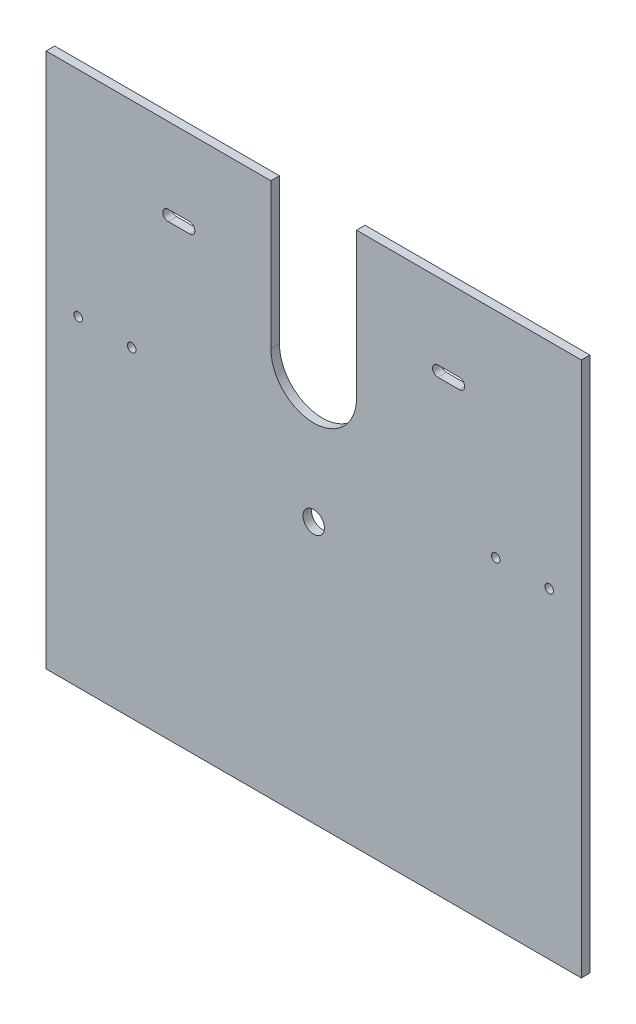
ISO-10303-21;
HEADER;
FILE_DESCRIPTION(('STEP AP214'),'2;1');
FILE_NAME('part.step','',(''),(''),'','','');
FILE_SCHEMA(('AUTOMOTIVE_DESIGN { 1 0 10303 214 1 1 1 1 }'));
ENDSEC;
DATA;
#1=APPLICATION_CONTEXT('core data for automotive mechanical design processes');
#2=APPLICATION_PROTOCOL_DEFINITION('international standard','automotive_design',2000,#1);
#3=PRODUCT_CONTEXT('',#1,'mechanical');
#4=PRODUCT('Part','Part','',(#3));
#5=PRODUCT_RELATED_PRODUCT_CATEGORY('part','',(#4));
#6=PRODUCT_DEFINITION_FORMATION('','',#4);
#7=PRODUCT_DEFINITION_CONTEXT('part definition',#1,'design');
#8=PRODUCT_DEFINITION('design','',#6,#7);
#9=PRODUCT_DEFINITION_SHAPE('','',#8);
#10=(LENGTH_UNIT() NAMED_UNIT(*) SI_UNIT(.MILLI.,.METRE.));
#11=(NAMED_UNIT(*) PLANE_ANGLE_UNIT() SI_UNIT($,.RADIAN.));
#12=(NAMED_UNIT(*) SI_UNIT($,.STERADIAN.) SOLID_ANGLE_UNIT());
#13=UNCERTAINTY_MEASURE_WITH_UNIT(LENGTH_MEASURE(1.E-05),#10,'distance_accuracy_value','');
#14=(GEOMETRIC_REPRESENTATION_CONTEXT(3) GLOBAL_UNCERTAINTY_ASSIGNED_CONTEXT((#13)) GLOBAL_UNIT_ASSIGNED_CONTEXT((#10,
#11,#12)) REPRESENTATION_CONTEXT('',''));
#15=CARTESIAN_POINT('',(0.,0.,0.));
#16=DIRECTION('',(0.,0.,1.));
#17=DIRECTION('',(1.,0.,0.));
#18=AXIS2_PLACEMENT_3D('',#15,#16,#17);
#19=CARTESIAN_POINT('',(125.,100.,4.));
#20=DIRECTION('',(0.,-1.,0.));
#21=DIRECTION('',(1.,0.,0.));
#22=AXIS2_PLACEMENT_3D('',#19,#20,#21);
#23=PLANE('',#22);
#24=DIRECTION('',(-1.,0.,0.));
#25=VECTOR('',#24,1.);
#26=CARTESIAN_POINT('',(125.,100.,4.));
#27=LINE('',#26,#25);
#28=CARTESIAN_POINT('',(-20.,100.,4.));
#29=VERTEX_POINT('',#28);
#30=CARTESIAN_POINT('',(-125.,100.,4.));
#31=VERTEX_POINT('',#30);
#32=EDGE_CURVE('E301',#29,#31,#27,.T.);
#33=ORIENTED_EDGE('',*,*,#32,.F.);
#34=DIRECTION('',(0.,0.,1.));
#35=VECTOR('',#34,1.);
#36=CARTESIAN_POINT('',(-20.,100.,0.));
#37=LINE('',#36,#35);
#38=CARTESIAN_POINT('',(-20.,100.,0.));
#39=VERTEX_POINT('',#38);
#40=EDGE_CURVE('E209',#39,#29,#37,.T.);
#41=ORIENTED_EDGE('',*,*,#40,.F.);
#42=DIRECTION('',(-1.,0.,0.));
#43=VECTOR('',#42,1.);
#44=CARTESIAN_POINT('',(125.,100.,0.));
#45=LINE('',#44,#43);
#46=CARTESIAN_POINT('',(-125.,100.,0.));
#47=VERTEX_POINT('',#46);
#48=EDGE_CURVE('E306',#39,#47,#45,.T.);
#49=ORIENTED_EDGE('',*,*,#48,.T.);
#50=DIRECTION('',(0.,0.,-1.));
#51=VECTOR('',#50,1.);
#52=CARTESIAN_POINT('',(-125.,100.,4.));
#53=LINE('',#52,#51);
#54=EDGE_CURVE('E47',#31,#47,#53,.T.);
#55=ORIENTED_EDGE('',*,*,#54,.F.);
#56=EDGE_LOOP('',(#33,#41,#49,#55));
#57=FACE_BOUND('',#56,.T.);
#58=ADVANCED_FACE('F39',(#57),#23,.F.);
#59=CARTESIAN_POINT('',(-125.,-100.,4.));
#60=DIRECTION('',(1.,0.,0.));
#61=DIRECTION('',(0.,0.,-1.));
#62=AXIS2_PLACEMENT_3D('',#59,#60,#61);
#63=PLANE('',#62);
#64=DIRECTION('',(0.,-1.,0.));
#65=VECTOR('',#64,1.);
#66=CARTESIAN_POINT('',(-125.,-100.,0.));
#67=LINE('',#66,#65);
#68=CARTESIAN_POINT('',(-125.,-150.,0.));
#69=VERTEX_POINT('',#68);
#70=EDGE_CURVE('E153',#47,#69,#67,.T.);
#71=ORIENTED_EDGE('',*,*,#70,.T.);
#72=DIRECTION('',(0.,0.,-1.));
#73=VECTOR('',#72,1.);
#74=CARTESIAN_POINT('',(-125.,-150.,4.));
#75=LINE('',#74,#73);
#76=CARTESIAN_POINT('',(-125.,-150.,4.));
#77=VERTEX_POINT('',#76);
#78=EDGE_CURVE('E157',#77,#69,#75,.T.);
#79=ORIENTED_EDGE('',*,*,#78,.F.);
#80=DIRECTION('',(0.,-1.,0.));
#81=VECTOR('',#80,1.);
#82=CARTESIAN_POINT('',(-125.,-100.,4.));
#83=LINE('',#82,#81);
#84=EDGE_CURVE('E296',#31,#77,#83,.T.);
#85=ORIENTED_EDGE('',*,*,#84,.F.);
#86=ORIENTED_EDGE('',*,*,#54,.T.);
#87=EDGE_LOOP('',(#71,#79,#85,#86));
#88=FACE_BOUND('',#87,.T.);
#89=ADVANCED_FACE('F41',(#88),#63,.F.);
#90=CARTESIAN_POINT('',(125.,-100.,4.));
#91=DIRECTION('',(-1.,0.,0.));
#92=DIRECTION('',(0.,0.,1.));
#93=AXIS2_PLACEMENT_3D('',#90,#91,#92);
#94=PLANE('',#93);
#95=DIRECTION('',(0.,1.,0.));
#96=VECTOR('',#95,1.);
#97=CARTESIAN_POINT('',(125.,-100.,0.));
#98=LINE('',#97,#96);
#99=CARTESIAN_POINT('',(125.,-150.,0.));
#100=VERTEX_POINT('',#99);
#101=CARTESIAN_POINT('',(125.,100.,0.));
#102=VERTEX_POINT('',#101);
#103=EDGE_CURVE('E161',#100,#102,#98,.T.);
#104=ORIENTED_EDGE('',*,*,#103,.T.);
#105=DIRECTION('',(0.,0.,-1.));
#106=VECTOR('',#105,1.);
#107=CARTESIAN_POINT('',(125.,100.,4.));
#108=LINE('',#107,#106);
#109=CARTESIAN_POINT('',(125.,100.,4.));
#110=VERTEX_POINT('',#109);
#111=EDGE_CURVE('E11',#110,#102,#108,.T.);
#112=ORIENTED_EDGE('',*,*,#111,.F.);
#113=DIRECTION('',(0.,1.,0.));
#114=VECTOR('',#113,1.);
#115=CARTESIAN_POINT('',(125.,-100.,4.));
#116=LINE('',#115,#114);
#117=CARTESIAN_POINT('',(125.,-150.,4.));
#118=VERTEX_POINT('',#117);
#119=EDGE_CURVE('E298',#118,#110,#116,.T.);
#120=ORIENTED_EDGE('',*,*,#119,.F.);
#121=DIRECTION('',(0.,0.,1.));
#122=VECTOR('',#121,1.);
#123=CARTESIAN_POINT('',(125.,-150.,4.));
#124=LINE('',#123,#122);
#125=EDGE_CURVE('E171',#100,#118,#124,.T.);
#126=ORIENTED_EDGE('',*,*,#125,.F.);
#127=EDGE_LOOP('',(#104,#112,#120,#126));
#128=FACE_BOUND('',#127,.T.);
#129=ADVANCED_FACE('F330',(#128),#94,.F.);
#130=CARTESIAN_POINT('',(20.,100.,0.));
#131=VERTEX_POINT('',#130);
#132=EDGE_CURVE('E299',#102,#131,#45,.T.);
#133=ORIENTED_EDGE('',*,*,#132,.T.);
#134=DIRECTION('',(0.,0.,1.));
#135=VECTOR('',#134,1.);
#136=CARTESIAN_POINT('',(20.,100.,0.));
#137=LINE('',#136,#135);
#138=CARTESIAN_POINT('',(20.,100.,4.));
#139=VERTEX_POINT('',#138);
#140=EDGE_CURVE('E211',#131,#139,#137,.T.);
#141=ORIENTED_EDGE('',*,*,#140,.T.);
#142=EDGE_CURVE('E302',#110,#139,#27,.T.);
#143=ORIENTED_EDGE('',*,*,#142,.F.);
#144=ORIENTED_EDGE('',*,*,#111,.T.);
#145=EDGE_LOOP('',(#133,#141,#143,#144));
#146=FACE_BOUND('',#145,.T.);
#147=ADVANCED_FACE('F324',(#146),#23,.F.);
#148=CARTESIAN_POINT('',(0.,0.,4.));
#149=DIRECTION('',(0.,0.,1.));
#150=DIRECTION('',(1.,0.,0.));
#151=AXIS2_PLACEMENT_3D('',#148,#149,#150);
#152=PLANE('',#151);
#153=CARTESIAN_POINT('',(0.,-28.,4.));
#154=DIRECTION('',(0.,0.,1.));
#155=DIRECTION('',(1.,0.,0.));
#156=AXIS2_PLACEMENT_3D('',#153,#154,#155);
#157=CIRCLE('',#156,5.);
#158=CARTESIAN_POINT('',(5.,-28.,4.));
#159=VERTEX_POINT('',#158);
#160=EDGE_CURVE('E185',#159,#159,#157,.T.);
#161=ORIENTED_EDGE('',*,*,#160,.F.);
#162=EDGE_LOOP('',(#161));
#163=FACE_BOUND('',#162,.T.);
#164=DIRECTION('',(0.,-1.,0.));
#165=VECTOR('',#164,1.);
#166=CARTESIAN_POINT('',(-20.,32.,4.));
#167=LINE('',#166,#165);
#168=CARTESIAN_POINT('',(-20.,32.,4.));
#169=VERTEX_POINT('',#168);
#170=EDGE_CURVE('E193',#29,#169,#167,.T.);
#171=ORIENTED_EDGE('',*,*,#170,.F.);
#172=ORIENTED_EDGE('',*,*,#32,.T.);
#173=ORIENTED_EDGE('',*,*,#84,.T.);
#174=DIRECTION('',(-1.,0.,0.));
#175=VECTOR('',#174,1.);
#176=CARTESIAN_POINT('',(-125.,-150.,4.));
#177=LINE('',#176,#175);
#178=EDGE_CURVE('E176',#118,#77,#177,.T.);
#179=ORIENTED_EDGE('',*,*,#178,.F.);
#180=ORIENTED_EDGE('',*,*,#119,.T.);
#181=ORIENTED_EDGE('',*,*,#142,.T.);
#182=DIRECTION('',(0.,1.,0.));
#183=VECTOR('',#182,1.);
#184=CARTESIAN_POINT('',(20.,32.,4.));
#185=LINE('',#184,#183);
#186=CARTESIAN_POINT('',(20.,32.,4.));
#187=VERTEX_POINT('',#186);
#188=EDGE_CURVE('E203',#187,#139,#185,.T.);
#189=ORIENTED_EDGE('',*,*,#188,.F.);
#190=CARTESIAN_POINT('',(0.,32.,4.));
#191=DIRECTION('',(0.,0.,1.));
#192=DIRECTION('',(1.,0.,0.));
#193=AXIS2_PLACEMENT_3D('',#190,#191,#192);
#194=CIRCLE('',#193,20.);
#195=EDGE_CURVE('E200',#169,#187,#194,.T.);
#196=ORIENTED_EDGE('',*,*,#195,.F.);
#197=EDGE_LOOP('',(#171,#172,#173,#179,#180,#181,#189,#196));
#198=FACE_BOUND('',#197,.T.);
#199=CARTESIAN_POINT('',(68.,62.,4.));
#200=DIRECTION('',(0.,0.,1.));
#201=DIRECTION('',(1.,0.,0.));
#202=AXIS2_PLACEMENT_3D('',#199,#200,#201);
#203=CIRCLE('',#202,2.5);
#204=CARTESIAN_POINT('',(68.,59.5,4.));
#205=VERTEX_POINT('',#204);
#206=CARTESIAN_POINT('',(68.,64.5,4.));
#207=VERTEX_POINT('',#206);
#208=EDGE_CURVE('E54',#205,#207,#203,.T.);
#209=ORIENTED_EDGE('',*,*,#208,.F.);
#210=DIRECTION('',(1.,0.,0.));
#211=VECTOR('',#210,1.);
#212=CARTESIAN_POINT('',(58.,59.5,4.));
#213=LINE('',#212,#211);
#214=CARTESIAN_POINT('',(58.,59.5,4.));
#215=VERTEX_POINT('',#214);
#216=EDGE_CURVE('E219',#215,#205,#213,.T.);
#217=ORIENTED_EDGE('',*,*,#216,.F.);
#218=CARTESIAN_POINT('',(58.,62.,4.));
#219=DIRECTION('',(0.,0.,1.));
#220=DIRECTION('',(1.,0.,0.));
#221=AXIS2_PLACEMENT_3D('',#218,#219,#220);
#222=CIRCLE('',#221,2.5);
#223=CARTESIAN_POINT('',(58.,64.5,4.));
#224=VERTEX_POINT('',#223);
#225=EDGE_CURVE('E234',#224,#215,#222,.T.);
#226=ORIENTED_EDGE('',*,*,#225,.F.);
#227=DIRECTION('',(-1.,0.,0.));
#228=VECTOR('',#227,1.);
#229=CARTESIAN_POINT('',(58.,64.5,4.));
#230=LINE('',#229,#228);
#231=EDGE_CURVE('E230',#207,#224,#230,.T.);
#232=ORIENTED_EDGE('',*,*,#231,.F.);
#233=EDGE_LOOP('',(#209,#217,#226,#232));
#234=FACE_BOUND('',#233,.T.);
#235=CARTESIAN_POINT('',(-68.,62.,4.));
#236=DIRECTION('',(0.,0.,1.));
#237=DIRECTION('',(1.,0.,0.));
#238=AXIS2_PLACEMENT_3D('',#235,#236,#237);
#239=CIRCLE('',#238,2.5);
#240=CARTESIAN_POINT('',(-68.,64.5,4.));
#241=VERTEX_POINT('',#240);
#242=CARTESIAN_POINT('',(-68.,59.5,4.));
#243=VERTEX_POINT('',#242);
#244=EDGE_CURVE('E62',#241,#243,#239,.T.);
#245=ORIENTED_EDGE('',*,*,#244,.F.);
#246=DIRECTION('',(-1.,0.,0.));
#247=VECTOR('',#246,1.);
#248=CARTESIAN_POINT('',(-68.,64.5,4.));
#249=LINE('',#248,#247);
#250=CARTESIAN_POINT('',(-58.,64.5,4.));
#251=VERTEX_POINT('',#250);
#252=EDGE_CURVE('E249',#251,#241,#249,.T.);
#253=ORIENTED_EDGE('',*,*,#252,.F.);
#254=CARTESIAN_POINT('',(-58.,62.,4.));
#255=DIRECTION('',(0.,0.,1.));
#256=DIRECTION('',(1.,0.,0.));
#257=AXIS2_PLACEMENT_3D('',#254,#255,#256);
#258=CIRCLE('',#257,2.5);
#259=CARTESIAN_POINT('',(-58.,59.5,4.));
#260=VERTEX_POINT('',#259);
#261=EDGE_CURVE('E263',#260,#251,#258,.T.);
#262=ORIENTED_EDGE('',*,*,#261,.F.);
#263=DIRECTION('',(1.,0.,0.));
#264=VECTOR('',#263,1.);
#265=CARTESIAN_POINT('',(-68.,59.5,4.));
#266=LINE('',#265,#264);
#267=EDGE_CURVE('E260',#243,#260,#266,.T.);
#268=ORIENTED_EDGE('',*,*,#267,.F.);
#269=EDGE_LOOP('',(#245,#253,#262,#268));
#270=FACE_BOUND('',#269,.T.);
#271=CARTESIAN_POINT('',(-110.,0.,4.));
#272=DIRECTION('',(0.,0.,1.));
#273=DIRECTION('',(1.,0.,0.));
#274=AXIS2_PLACEMENT_3D('',#271,#272,#273);
#275=CIRCLE('',#274,2.);
#276=CARTESIAN_POINT('',(-108.,0.,4.));
#277=VERTEX_POINT('',#276);
#278=EDGE_CURVE('E276',#277,#277,#275,.T.);
#279=ORIENTED_EDGE('',*,*,#278,.F.);
#280=EDGE_LOOP('',(#279));
#281=FACE_BOUND('',#280,.T.);
#282=CARTESIAN_POINT('',(85.,0.,4.));
#283=DIRECTION('',(0.,0.,1.));
#284=DIRECTION('',(1.,0.,0.));
#285=AXIS2_PLACEMENT_3D('',#282,#283,#284);
#286=CIRCLE('',#285,2.);
#287=CARTESIAN_POINT('',(87.,0.,4.));
#288=VERTEX_POINT('',#287);
#289=EDGE_CURVE('E184',#288,#288,#286,.T.);
#290=ORIENTED_EDGE('',*,*,#289,.F.);
#291=EDGE_LOOP('',(#290));
#292=FACE_BOUND('',#291,.T.);
#293=CARTESIAN_POINT('',(110.,0.,4.));
#294=DIRECTION('',(0.,0.,1.));
#295=DIRECTION('',(1.,0.,0.));
#296=AXIS2_PLACEMENT_3D('',#293,#294,#295);
#297=CIRCLE('',#296,2.);
#298=CARTESIAN_POINT('',(112.,0.,4.));
#299=VERTEX_POINT('',#298);
#300=EDGE_CURVE('E283',#299,#299,#297,.T.);
#301=ORIENTED_EDGE('',*,*,#300,.F.);
#302=EDGE_LOOP('',(#301));
#303=FACE_BOUND('',#302,.T.);
#304=CARTESIAN_POINT('',(-85.0000000000001,0.,4.));
#305=DIRECTION('',(0.,0.,1.));
#306=DIRECTION('',(1.,0.,0.));
#307=AXIS2_PLACEMENT_3D('',#304,#305,#306);
#308=CIRCLE('',#307,2.);
#309=CARTESIAN_POINT('',(-83.0000000000001,0.,4.));
#310=VERTEX_POINT('',#309);
#311=EDGE_CURVE('E288',#310,#310,#308,.T.);
#312=ORIENTED_EDGE('',*,*,#311,.F.);
#313=EDGE_LOOP('',(#312));
#314=FACE_BOUND('',#313,.T.);
#315=ADVANCED_FACE('F326',(#163,#198,#234,#270,#281,#292,#303,#314),#152,.T.);
#316=CARTESIAN_POINT('',(0.,0.,0.));
#317=DIRECTION('',(0.,0.,1.));
#318=DIRECTION('',(1.,0.,0.));
#319=AXIS2_PLACEMENT_3D('',#316,#317,#318);
#320=PLANE('',#319);
#321=CARTESIAN_POINT('',(0.,-28.,0.));
#322=DIRECTION('',(0.,0.,1.));
#323=DIRECTION('',(1.,0.,0.));
#324=AXIS2_PLACEMENT_3D('',#321,#322,#323);
#325=CIRCLE('',#324,5.);
#326=CARTESIAN_POINT('',(5.,-28.,0.));
#327=VERTEX_POINT('',#326);
#328=EDGE_CURVE('E181',#327,#327,#325,.T.);
#329=ORIENTED_EDGE('',*,*,#328,.T.);
#330=EDGE_LOOP('',(#329));
#331=FACE_BOUND('',#330,.T.);
#332=DIRECTION('',(1.,0.,0.));
#333=VECTOR('',#332,1.);
#334=CARTESIAN_POINT('',(58.,59.5,0.));
#335=LINE('',#334,#333);
#336=CARTESIAN_POINT('',(58.,59.5,0.));
#337=VERTEX_POINT('',#336);
#338=CARTESIAN_POINT('',(68.,59.5,0.));
#339=VERTEX_POINT('',#338);
#340=EDGE_CURVE('E225',#337,#339,#335,.T.);
#341=ORIENTED_EDGE('',*,*,#340,.T.);
#342=CARTESIAN_POINT('',(68.,62.,0.));
#343=DIRECTION('',(0.,0.,1.));
#344=DIRECTION('',(1.,0.,0.));
#345=AXIS2_PLACEMENT_3D('',#342,#343,#344);
#346=CIRCLE('',#345,2.5);
#347=CARTESIAN_POINT('',(68.,64.5,0.));
#348=VERTEX_POINT('',#347);
#349=EDGE_CURVE('E215',#339,#348,#346,.T.);
#350=ORIENTED_EDGE('',*,*,#349,.T.);
#351=DIRECTION('',(-1.,0.,0.));
#352=VECTOR('',#351,1.);
#353=CARTESIAN_POINT('',(58.,64.5,0.));
#354=LINE('',#353,#352);
#355=CARTESIAN_POINT('',(58.,64.5,0.));
#356=VERTEX_POINT('',#355);
#357=EDGE_CURVE('E218',#348,#356,#354,.T.);
#358=ORIENTED_EDGE('',*,*,#357,.T.);
#359=CARTESIAN_POINT('',(58.,62.,0.));
#360=DIRECTION('',(0.,0.,1.));
#361=DIRECTION('',(1.,0.,0.));
#362=AXIS2_PLACEMENT_3D('',#359,#360,#361);
#363=CIRCLE('',#362,2.5);
#364=EDGE_CURVE('E222',#356,#337,#363,.T.);
#365=ORIENTED_EDGE('',*,*,#364,.T.);
#366=EDGE_LOOP('',(#341,#350,#358,#365));
#367=FACE_BOUND('',#366,.T.);
#368=DIRECTION('',(-1.,0.,0.));
#369=VECTOR('',#368,1.);
#370=CARTESIAN_POINT('',(-68.,64.5,0.));
#371=LINE('',#370,#369);
#372=CARTESIAN_POINT('',(-58.,64.5,0.));
#373=VERTEX_POINT('',#372);
#374=CARTESIAN_POINT('',(-68.,64.5,0.));
#375=VERTEX_POINT('',#374);
#376=EDGE_CURVE('E255',#373,#375,#371,.T.);
#377=ORIENTED_EDGE('',*,*,#376,.T.);
#378=CARTESIAN_POINT('',(-68.,62.,0.));
#379=DIRECTION('',(0.,0.,1.));
#380=DIRECTION('',(1.,0.,0.));
#381=AXIS2_PLACEMENT_3D('',#378,#379,#380);
#382=CIRCLE('',#381,2.5);
#383=CARTESIAN_POINT('',(-68.,59.5,0.));
#384=VERTEX_POINT('',#383);
#385=EDGE_CURVE('E245',#375,#384,#382,.T.);
#386=ORIENTED_EDGE('',*,*,#385,.T.);
#387=DIRECTION('',(1.,0.,0.));
#388=VECTOR('',#387,1.);
#389=CARTESIAN_POINT('',(-68.,59.5,0.));
#390=LINE('',#389,#388);
#391=CARTESIAN_POINT('',(-58.,59.5,0.));
#392=VERTEX_POINT('',#391);
#393=EDGE_CURVE('E248',#384,#392,#390,.T.);
#394=ORIENTED_EDGE('',*,*,#393,.T.);
#395=CARTESIAN_POINT('',(-58.,62.,0.));
#396=DIRECTION('',(0.,0.,1.));
#397=DIRECTION('',(1.,0.,0.));
#398=AXIS2_PLACEMENT_3D('',#395,#396,#397);
#399=CIRCLE('',#398,2.5);
#400=EDGE_CURVE('E252',#392,#373,#399,.T.);
#401=ORIENTED_EDGE('',*,*,#400,.T.);
#402=EDGE_LOOP('',(#377,#386,#394,#401));
#403=FACE_BOUND('',#402,.T.);
#404=CARTESIAN_POINT('',(-110.,0.,0.));
#405=DIRECTION('',(0.,0.,1.));
#406=DIRECTION('',(1.,0.,0.));
#407=AXIS2_PLACEMENT_3D('',#404,#405,#406);
#408=CIRCLE('',#407,2.);
#409=CARTESIAN_POINT('',(-108.,0.,0.));
#410=VERTEX_POINT('',#409);
#411=EDGE_CURVE('E162',#410,#410,#408,.T.);
#412=ORIENTED_EDGE('',*,*,#411,.T.);
#413=EDGE_LOOP('',(#412));
#414=FACE_BOUND('',#413,.T.);
#415=CARTESIAN_POINT('',(85.,0.,0.));
#416=DIRECTION('',(0.,0.,1.));
#417=DIRECTION('',(1.,0.,0.));
#418=AXIS2_PLACEMENT_3D('',#415,#416,#417);
#419=CIRCLE('',#418,2.);
#420=CARTESIAN_POINT('',(87.,0.,0.));
#421=VERTEX_POINT('',#420);
#422=EDGE_CURVE('E280',#421,#421,#419,.T.);
#423=ORIENTED_EDGE('',*,*,#422,.T.);
#424=EDGE_LOOP('',(#423));
#425=FACE_BOUND('',#424,.T.);
#426=CARTESIAN_POINT('',(110.,0.,0.));
#427=DIRECTION('',(0.,0.,1.));
#428=DIRECTION('',(1.,0.,0.));
#429=AXIS2_PLACEMENT_3D('',#426,#427,#428);
#430=CIRCLE('',#429,2.);
#431=CARTESIAN_POINT('',(112.,0.,0.));
#432=VERTEX_POINT('',#431);
#433=EDGE_CURVE('E291',#432,#432,#430,.T.);
#434=ORIENTED_EDGE('',*,*,#433,.T.);
#435=EDGE_LOOP('',(#434));
#436=FACE_BOUND('',#435,.T.);
#437=CARTESIAN_POINT('',(-85.0000000000001,0.,0.));
#438=DIRECTION('',(0.,0.,1.));
#439=DIRECTION('',(1.,0.,0.));
#440=AXIS2_PLACEMENT_3D('',#437,#438,#439);
#441=CIRCLE('',#440,2.);
#442=CARTESIAN_POINT('',(-83.0000000000001,0.,0.));
#443=VERTEX_POINT('',#442);
#444=EDGE_CURVE('E279',#443,#443,#441,.T.);
#445=ORIENTED_EDGE('',*,*,#444,.T.);
#446=EDGE_LOOP('',(#445));
#447=FACE_BOUND('',#446,.T.);
#448=ORIENTED_EDGE('',*,*,#48,.F.);
#449=DIRECTION('',(0.,-1.,0.));
#450=VECTOR('',#449,1.);
#451=CARTESIAN_POINT('',(-20.,32.,0.));
#452=LINE('',#451,#450);
#453=CARTESIAN_POINT('',(-20.,32.,0.));
#454=VERTEX_POINT('',#453);
#455=EDGE_CURVE('E196',#39,#454,#452,.T.);
#456=ORIENTED_EDGE('',*,*,#455,.T.);
#457=CARTESIAN_POINT('',(0.,32.,0.));
#458=DIRECTION('',(0.,0.,1.));
#459=DIRECTION('',(1.,0.,0.));
#460=AXIS2_PLACEMENT_3D('',#457,#458,#459);
#461=CIRCLE('',#460,20.);
#462=CARTESIAN_POINT('',(20.,32.,0.));
#463=VERTEX_POINT('',#462);
#464=EDGE_CURVE('E189',#454,#463,#461,.T.);
#465=ORIENTED_EDGE('',*,*,#464,.T.);
#466=DIRECTION('',(0.,1.,0.));
#467=VECTOR('',#466,1.);
#468=CARTESIAN_POINT('',(20.,32.,0.));
#469=LINE('',#468,#467);
#470=EDGE_CURVE('E192',#463,#131,#469,.T.);
#471=ORIENTED_EDGE('',*,*,#470,.T.);
#472=ORIENTED_EDGE('',*,*,#132,.F.);
#473=ORIENTED_EDGE('',*,*,#103,.F.);
#474=DIRECTION('',(1.,0.,0.));
#475=VECTOR('',#474,1.);
#476=CARTESIAN_POINT('',(-125.,-150.,0.));
#477=LINE('',#476,#475);
#478=EDGE_CURVE('E165',#69,#100,#477,.T.);
#479=ORIENTED_EDGE('',*,*,#478,.F.);
#480=ORIENTED_EDGE('',*,*,#70,.F.);
#481=EDGE_LOOP('',(#448,#456,#465,#471,#472,#473,#479,#480));
#482=FACE_BOUND('',#481,.T.);
#483=ADVANCED_FACE('F166',(#331,#367,#403,#414,#425,#436,#447,#482),#320,.F.);
#484=CARTESIAN_POINT('',(-85.0000000000001,0.,0.));
#485=DIRECTION('',(0.,0.,1.));
#486=DIRECTION('',(1.,0.,0.));
#487=AXIS2_PLACEMENT_3D('',#484,#485,#486);
#488=CYLINDRICAL_SURFACE('',#487,2.);
#489=ORIENTED_EDGE('',*,*,#444,.F.);
#490=EDGE_LOOP('',(#489));
#491=FACE_BOUND('',#490,.T.);
#492=ORIENTED_EDGE('',*,*,#311,.T.);
#493=EDGE_LOOP('',(#492));
#494=FACE_BOUND('',#493,.T.);
#495=ADVANCED_FACE('F343',(#491,#494),#488,.F.);
#496=CARTESIAN_POINT('',(110.,0.,0.));
#497=DIRECTION('',(0.,0.,1.));
#498=DIRECTION('',(1.,0.,0.));
#499=AXIS2_PLACEMENT_3D('',#496,#497,#498);
#500=CYLINDRICAL_SURFACE('',#499,2.);
#501=ORIENTED_EDGE('',*,*,#433,.F.);
#502=EDGE_LOOP('',(#501));
#503=FACE_BOUND('',#502,.T.);
#504=ORIENTED_EDGE('',*,*,#300,.T.);
#505=EDGE_LOOP('',(#504));
#506=FACE_BOUND('',#505,.T.);
#507=ADVANCED_FACE('F348',(#503,#506),#500,.F.);
#508=CARTESIAN_POINT('',(85.,0.,0.));
#509=DIRECTION('',(0.,0.,1.));
#510=DIRECTION('',(1.,0.,0.));
#511=AXIS2_PLACEMENT_3D('',#508,#509,#510);
#512=CYLINDRICAL_SURFACE('',#511,2.);
#513=ORIENTED_EDGE('',*,*,#422,.F.);
#514=EDGE_LOOP('',(#513));
#515=FACE_BOUND('',#514,.T.);
#516=ORIENTED_EDGE('',*,*,#289,.T.);
#517=EDGE_LOOP('',(#516));
#518=FACE_BOUND('',#517,.T.);
#519=ADVANCED_FACE('F351',(#515,#518),#512,.F.);
#520=CARTESIAN_POINT('',(-110.,0.,0.));
#521=DIRECTION('',(0.,0.,1.));
#522=DIRECTION('',(1.,0.,0.));
#523=AXIS2_PLACEMENT_3D('',#520,#521,#522);
#524=CYLINDRICAL_SURFACE('',#523,2.);
#525=ORIENTED_EDGE('',*,*,#411,.F.);
#526=EDGE_LOOP('',(#525));
#527=FACE_BOUND('',#526,.T.);
#528=ORIENTED_EDGE('',*,*,#278,.T.);
#529=EDGE_LOOP('',(#528));
#530=FACE_BOUND('',#529,.T.);
#531=ADVANCED_FACE('F358',(#527,#530),#524,.F.);
#532=CARTESIAN_POINT('',(-68.,62.,0.));
#533=DIRECTION('',(0.,0.,1.));
#534=DIRECTION('',(1.,0.,0.));
#535=AXIS2_PLACEMENT_3D('',#532,#533,#534);
#536=CYLINDRICAL_SURFACE('',#535,2.5);
#537=ORIENTED_EDGE('',*,*,#244,.T.);
#538=DIRECTION('',(0.,0.,1.));
#539=VECTOR('',#538,1.);
#540=CARTESIAN_POINT('',(-68.,59.5,0.));
#541=LINE('',#540,#539);
#542=EDGE_CURVE('E258',#384,#243,#541,.T.);
#543=ORIENTED_EDGE('',*,*,#542,.F.);
#544=ORIENTED_EDGE('',*,*,#385,.F.);
#545=DIRECTION('',(0.,0.,1.));
#546=VECTOR('',#545,1.);
#547=CARTESIAN_POINT('',(-68.,64.5,0.));
#548=LINE('',#547,#546);
#549=EDGE_CURVE('E231',#375,#241,#548,.T.);
#550=ORIENTED_EDGE('',*,*,#549,.T.);
#551=EDGE_LOOP('',(#537,#543,#544,#550));
#552=FACE_BOUND('',#551,.T.);
#553=ADVANCED_FACE('F362',(#552),#536,.F.);
#554=CARTESIAN_POINT('',(-68.,64.5,0.));
#555=DIRECTION('',(0.,1.,0.));
#556=DIRECTION('',(0.,0.,1.));
#557=AXIS2_PLACEMENT_3D('',#554,#555,#556);
#558=PLANE('',#557);
#559=ORIENTED_EDGE('',*,*,#252,.T.);
#560=ORIENTED_EDGE('',*,*,#549,.F.);
#561=ORIENTED_EDGE('',*,*,#376,.F.);
#562=DIRECTION('',(0.,0.,1.));
#563=VECTOR('',#562,1.);
#564=CARTESIAN_POINT('',(-58.,64.5,0.));
#565=LINE('',#564,#563);
#566=EDGE_CURVE('E269',#373,#251,#565,.T.);
#567=ORIENTED_EDGE('',*,*,#566,.T.);
#568=EDGE_LOOP('',(#559,#560,#561,#567));
#569=FACE_BOUND('',#568,.T.);
#570=ADVANCED_FACE('F366',(#569),#558,.F.);
#571=CARTESIAN_POINT('',(-58.,62.,0.));
#572=DIRECTION('',(0.,0.,1.));
#573=DIRECTION('',(1.,0.,0.));
#574=AXIS2_PLACEMENT_3D('',#571,#572,#573);
#575=CYLINDRICAL_SURFACE('',#574,2.5);
#576=ORIENTED_EDGE('',*,*,#261,.T.);
#577=ORIENTED_EDGE('',*,*,#566,.F.);
#578=ORIENTED_EDGE('',*,*,#400,.F.);
#579=DIRECTION('',(0.,0.,1.));
#580=VECTOR('',#579,1.);
#581=CARTESIAN_POINT('',(-58.,59.5,0.));
#582=LINE('',#581,#580);
#583=EDGE_CURVE('E271',#392,#260,#582,.T.);
#584=ORIENTED_EDGE('',*,*,#583,.T.);
#585=EDGE_LOOP('',(#576,#577,#578,#584));
#586=FACE_BOUND('',#585,.T.);
#587=ADVANCED_FACE('F371',(#586),#575,.F.);
#588=CARTESIAN_POINT('',(-68.,59.5,0.));
#589=DIRECTION('',(0.,-1.,0.));
#590=DIRECTION('',(1.,0.,0.));
#591=AXIS2_PLACEMENT_3D('',#588,#589,#590);
#592=PLANE('',#591);
#593=ORIENTED_EDGE('',*,*,#267,.T.);
#594=ORIENTED_EDGE('',*,*,#583,.F.);
#595=ORIENTED_EDGE('',*,*,#393,.F.);
#596=ORIENTED_EDGE('',*,*,#542,.T.);
#597=EDGE_LOOP('',(#593,#594,#595,#596));
#598=FACE_BOUND('',#597,.T.);
#599=ADVANCED_FACE('F367',(#598),#592,.F.);
#600=CARTESIAN_POINT('',(68.,62.,0.));
#601=DIRECTION('',(0.,0.,1.));
#602=DIRECTION('',(1.,0.,0.));
#603=AXIS2_PLACEMENT_3D('',#600,#601,#602);
#604=CYLINDRICAL_SURFACE('',#603,2.5);
#605=ORIENTED_EDGE('',*,*,#208,.T.);
#606=DIRECTION('',(0.,0.,1.));
#607=VECTOR('',#606,1.);
#608=CARTESIAN_POINT('',(68.,64.5,0.));
#609=LINE('',#608,#607);
#610=EDGE_CURVE('E228',#348,#207,#609,.T.);
#611=ORIENTED_EDGE('',*,*,#610,.F.);
#612=ORIENTED_EDGE('',*,*,#349,.F.);
#613=DIRECTION('',(0.,0.,1.));
#614=VECTOR('',#613,1.);
#615=CARTESIAN_POINT('',(68.,59.5,0.));
#616=LINE('',#615,#614);
#617=EDGE_CURVE('E204',#339,#205,#616,.T.);
#618=ORIENTED_EDGE('',*,*,#617,.T.);
#619=EDGE_LOOP('',(#605,#611,#612,#618));
#620=FACE_BOUND('',#619,.T.);
#621=ADVANCED_FACE('F370',(#620),#604,.F.);
#622=CARTESIAN_POINT('',(58.,59.5,0.));
#623=DIRECTION('',(0.,-1.,0.));
#624=DIRECTION('',(1.,0.,0.));
#625=AXIS2_PLACEMENT_3D('',#622,#623,#624);
#626=PLANE('',#625);
#627=ORIENTED_EDGE('',*,*,#216,.T.);
#628=ORIENTED_EDGE('',*,*,#617,.F.);
#629=ORIENTED_EDGE('',*,*,#340,.F.);
#630=DIRECTION('',(0.,0.,1.));
#631=VECTOR('',#630,1.);
#632=CARTESIAN_POINT('',(58.,59.5,0.));
#633=LINE('',#632,#631);
#634=EDGE_CURVE('E240',#337,#215,#633,.T.);
#635=ORIENTED_EDGE('',*,*,#634,.T.);
#636=EDGE_LOOP('',(#627,#628,#629,#635));
#637=FACE_BOUND('',#636,.T.);
#638=ADVANCED_FACE('F381',(#637),#626,.F.);
#639=CARTESIAN_POINT('',(58.,62.,0.));
#640=DIRECTION('',(0.,0.,1.));
#641=DIRECTION('',(1.,0.,0.));
#642=AXIS2_PLACEMENT_3D('',#639,#640,#641);
#643=CYLINDRICAL_SURFACE('',#642,2.5);
#644=ORIENTED_EDGE('',*,*,#225,.T.);
#645=ORIENTED_EDGE('',*,*,#634,.F.);
#646=ORIENTED_EDGE('',*,*,#364,.F.);
#647=DIRECTION('',(0.,0.,1.));
#648=VECTOR('',#647,1.);
#649=CARTESIAN_POINT('',(58.,64.5,0.));
#650=LINE('',#649,#648);
#651=EDGE_CURVE('E242',#356,#224,#650,.T.);
#652=ORIENTED_EDGE('',*,*,#651,.T.);
#653=EDGE_LOOP('',(#644,#645,#646,#652));
#654=FACE_BOUND('',#653,.T.);
#655=ADVANCED_FACE('F385',(#654),#643,.F.);
#656=CARTESIAN_POINT('',(58.,64.5,0.));
#657=DIRECTION('',(0.,1.,0.));
#658=DIRECTION('',(0.,0.,1.));
#659=AXIS2_PLACEMENT_3D('',#656,#657,#658);
#660=PLANE('',#659);
#661=ORIENTED_EDGE('',*,*,#231,.T.);
#662=ORIENTED_EDGE('',*,*,#651,.F.);
#663=ORIENTED_EDGE('',*,*,#357,.F.);
#664=ORIENTED_EDGE('',*,*,#610,.T.);
#665=EDGE_LOOP('',(#661,#662,#663,#664));
#666=FACE_BOUND('',#665,.T.);
#667=ADVANCED_FACE('F382',(#666),#660,.F.);
#668=CARTESIAN_POINT('',(0.,32.,0.));
#669=DIRECTION('',(0.,0.,1.));
#670=DIRECTION('',(1.,0.,0.));
#671=AXIS2_PLACEMENT_3D('',#668,#669,#670);
#672=CYLINDRICAL_SURFACE('',#671,20.);
#673=ORIENTED_EDGE('',*,*,#195,.T.);
#674=DIRECTION('',(0.,0.,1.));
#675=VECTOR('',#674,1.);
#676=CARTESIAN_POINT('',(20.,32.,0.));
#677=LINE('',#676,#675);
#678=EDGE_CURVE('E199',#463,#187,#677,.T.);
#679=ORIENTED_EDGE('',*,*,#678,.F.);
#680=ORIENTED_EDGE('',*,*,#464,.F.);
#681=DIRECTION('',(0.,0.,1.));
#682=VECTOR('',#681,1.);
#683=CARTESIAN_POINT('',(-20.,32.,0.));
#684=LINE('',#683,#682);
#685=EDGE_CURVE('E188',#454,#169,#684,.T.);
#686=ORIENTED_EDGE('',*,*,#685,.T.);
#687=EDGE_LOOP('',(#673,#679,#680,#686));
#688=FACE_BOUND('',#687,.T.);
#689=ADVANCED_FACE('F318',(#688),#672,.F.);
#690=CARTESIAN_POINT('',(-20.,32.,0.));
#691=DIRECTION('',(-1.,0.,0.));
#692=DIRECTION('',(0.,-1.,0.));
#693=AXIS2_PLACEMENT_3D('',#690,#691,#692);
#694=PLANE('',#693);
#695=ORIENTED_EDGE('',*,*,#170,.T.);
#696=ORIENTED_EDGE('',*,*,#685,.F.);
#697=ORIENTED_EDGE('',*,*,#455,.F.);
#698=ORIENTED_EDGE('',*,*,#40,.T.);
#699=EDGE_LOOP('',(#695,#696,#697,#698));
#700=FACE_BOUND('',#699,.T.);
#701=ADVANCED_FACE('F314',(#700),#694,.F.);
#702=CARTESIAN_POINT('',(20.,32.,0.));
#703=DIRECTION('',(1.,0.,0.));
#704=DIRECTION('',(0.,1.,0.));
#705=AXIS2_PLACEMENT_3D('',#702,#703,#704);
#706=PLANE('',#705);
#707=ORIENTED_EDGE('',*,*,#188,.T.);
#708=ORIENTED_EDGE('',*,*,#140,.F.);
#709=ORIENTED_EDGE('',*,*,#470,.F.);
#710=ORIENTED_EDGE('',*,*,#678,.T.);
#711=EDGE_LOOP('',(#707,#708,#709,#710));
#712=FACE_BOUND('',#711,.T.);
#713=ADVANCED_FACE('F322',(#712),#706,.F.);
#714=CARTESIAN_POINT('',(0.,-28.,0.));
#715=DIRECTION('',(0.,0.,1.));
#716=DIRECTION('',(1.,0.,0.));
#717=AXIS2_PLACEMENT_3D('',#714,#715,#716);
#718=CYLINDRICAL_SURFACE('',#717,5.);
#719=ORIENTED_EDGE('',*,*,#328,.F.);
#720=EDGE_LOOP('',(#719));
#721=FACE_BOUND('',#720,.T.);
#722=ORIENTED_EDGE('',*,*,#160,.T.);
#723=EDGE_LOOP('',(#722));
#724=FACE_BOUND('',#723,.T.);
#725=ADVANCED_FACE('F397',(#721,#724),#718,.F.);
#726=CARTESIAN_POINT('',(0.,-150.,0.));
#727=DIRECTION('',(0.,-1.,0.));
#728=DIRECTION('',(1.,0.,0.));
#729=AXIS2_PLACEMENT_3D('',#726,#727,#728);
#730=PLANE('',#729);
#731=ORIENTED_EDGE('',*,*,#78,.T.);
#732=ORIENTED_EDGE('',*,*,#478,.T.);
#733=ORIENTED_EDGE('',*,*,#125,.T.);
#734=ORIENTED_EDGE('',*,*,#178,.T.);
#735=EDGE_LOOP('',(#731,#732,#733,#734));
#736=FACE_BOUND('',#735,.T.);
#737=ADVANCED_FACE('F174',(#736),#730,.T.);
#738=CLOSED_SHELL('',(#58,#89,#129,#147,#315,#483,#495,#507,#519,#531,#553,#570,#587,#599,#621,
#638,#655,#667,#689,#701,#713,#725,#737));
#739=MANIFOLD_SOLID_BREP('B2',#738);
#740=ADVANCED_BREP_SHAPE_REPRESENTATION('',(#18,#739),#14);
#741=SHAPE_DEFINITION_REPRESENTATION(#9,#740);
ENDSEC;
END-ISO-10303-21;
